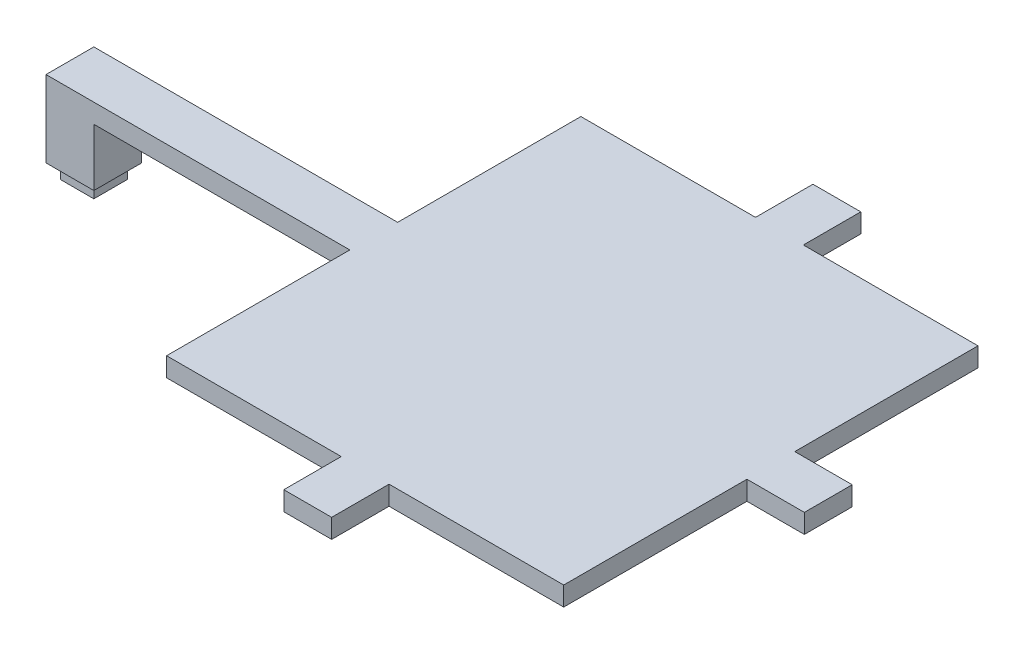
ISO-10303-21;
HEADER;
FILE_DESCRIPTION(('STEP AP214'),'2;1');
FILE_NAME('part.step','',(''),(''),'','','');
FILE_SCHEMA(('AUTOMOTIVE_DESIGN { 1 0 10303 214 1 1 1 1 }'));
ENDSEC;
DATA;
#1=APPLICATION_CONTEXT('core data for automotive mechanical design processes');
#2=APPLICATION_PROTOCOL_DEFINITION('international standard','automotive_design',2000,#1);
#3=PRODUCT_CONTEXT('',#1,'mechanical');
#4=PRODUCT('Part','Part','',(#3));
#5=PRODUCT_RELATED_PRODUCT_CATEGORY('part','',(#4));
#6=PRODUCT_DEFINITION_FORMATION('','',#4);
#7=PRODUCT_DEFINITION_CONTEXT('part definition',#1,'design');
#8=PRODUCT_DEFINITION('design','',#6,#7);
#9=PRODUCT_DEFINITION_SHAPE('','',#8);
#10=(LENGTH_UNIT() NAMED_UNIT(*) SI_UNIT(.MILLI.,.METRE.));
#11=(NAMED_UNIT(*) PLANE_ANGLE_UNIT() SI_UNIT($,.RADIAN.));
#12=(NAMED_UNIT(*) SI_UNIT($,.STERADIAN.) SOLID_ANGLE_UNIT());
#13=UNCERTAINTY_MEASURE_WITH_UNIT(LENGTH_MEASURE(1.E-05),#10,'distance_accuracy_value','');
#14=(GEOMETRIC_REPRESENTATION_CONTEXT(3) GLOBAL_UNCERTAINTY_ASSIGNED_CONTEXT((#13)) GLOBAL_UNIT_ASSIGNED_CONTEXT((#10,
#11,#12)) REPRESENTATION_CONTEXT('',''));
#15=CARTESIAN_POINT('',(0.,0.,0.));
#16=DIRECTION('',(0.,0.,1.));
#17=DIRECTION('',(1.,0.,0.));
#18=AXIS2_PLACEMENT_3D('',#15,#16,#17);
#19=CARTESIAN_POINT('',(58.5,19.,-43.2944735512046));
#20=DIRECTION('',(1.,0.,0.));
#21=DIRECTION('',(0.,0.,-1.));
#22=AXIS2_PLACEMENT_3D('',#19,#20,#21);
#23=PLANE('',#22);
#24=DIRECTION('',(0.,0.,1.));
#25=VECTOR('',#24,1.);
#26=CARTESIAN_POINT('',(58.5,15.,-43.2944735512046));
#27=LINE('',#26,#25);
#28=CARTESIAN_POINT('',(58.5,15.,-43.2944735512046));
#29=VERTEX_POINT('',#28);
#30=CARTESIAN_POINT('',(58.5,15.,-5.));
#31=VERTEX_POINT('',#30);
#32=EDGE_CURVE('E225',#29,#31,#27,.T.);
#33=ORIENTED_EDGE('',*,*,#32,.T.);
#34=DIRECTION('',(0.,1.,0.));
#35=VECTOR('',#34,1.);
#36=CARTESIAN_POINT('',(58.5,19.,-5.));
#37=LINE('',#36,#35);
#38=CARTESIAN_POINT('',(58.5,19.,-5.));
#39=VERTEX_POINT('',#38);
#40=EDGE_CURVE('E318',#31,#39,#37,.T.);
#41=ORIENTED_EDGE('',*,*,#40,.T.);
#42=DIRECTION('',(0.,0.,1.));
#43=VECTOR('',#42,1.);
#44=CARTESIAN_POINT('',(58.5,19.,-43.2944735512046));
#45=LINE('',#44,#43);
#46=CARTESIAN_POINT('',(58.5,19.,-43.2944735512046));
#47=VERTEX_POINT('',#46);
#48=EDGE_CURVE('E189',#47,#39,#45,.T.);
#49=ORIENTED_EDGE('',*,*,#48,.F.);
#50=DIRECTION('',(0.,-1.,0.));
#51=VECTOR('',#50,1.);
#52=CARTESIAN_POINT('',(58.5,19.,-43.2944735512046));
#53=LINE('',#52,#51);
#54=EDGE_CURVE('E183',#47,#29,#53,.T.);
#55=ORIENTED_EDGE('',*,*,#54,.T.);
#56=EDGE_LOOP('',(#33,#41,#49,#55));
#57=FACE_BOUND('',#56,.T.);
#58=ADVANCED_FACE('F33',(#57),#23,.F.);
#59=CARTESIAN_POINT('',(95.,19.,43.2944735512046));
#60=DIRECTION('',(0.,0.,-1.));
#61=DIRECTION('',(-1.,0.,0.));
#62=AXIS2_PLACEMENT_3D('',#59,#60,#61);
#63=PLANE('',#62);
#64=DIRECTION('',(1.,0.,0.));
#65=VECTOR('',#64,1.);
#66=CARTESIAN_POINT('',(95.,15.,43.2944735512046));
#67=LINE('',#66,#65);
#68=CARTESIAN_POINT('',(58.5,15.,43.2944735512046));
#69=VERTEX_POINT('',#68);
#70=CARTESIAN_POINT('',(95.,15.,43.2944735512046));
#71=VERTEX_POINT('',#70);
#72=EDGE_CURVE('E194',#69,#71,#67,.T.);
#73=ORIENTED_EDGE('',*,*,#72,.T.);
#74=DIRECTION('',(0.,-1.,0.));
#75=VECTOR('',#74,1.);
#76=CARTESIAN_POINT('',(95.,19.,43.2944735512046));
#77=LINE('',#76,#75);
#78=CARTESIAN_POINT('',(95.,19.,43.2944735512046));
#79=VERTEX_POINT('',#78);
#80=EDGE_CURVE('E11',#79,#71,#77,.T.);
#81=ORIENTED_EDGE('',*,*,#80,.F.);
#82=DIRECTION('',(1.,0.,0.));
#83=VECTOR('',#82,1.);
#84=CARTESIAN_POINT('',(95.,19.,43.2944735512046));
#85=LINE('',#84,#83);
#86=CARTESIAN_POINT('',(58.5,19.,43.2944735512046));
#87=VERTEX_POINT('',#86);
#88=EDGE_CURVE('E228',#87,#79,#85,.T.);
#89=ORIENTED_EDGE('',*,*,#88,.F.);
#90=DIRECTION('',(0.,-1.,0.));
#91=VECTOR('',#90,1.);
#92=CARTESIAN_POINT('',(58.5,19.,43.2944735512046));
#93=LINE('',#92,#91);
#94=EDGE_CURVE('E193',#87,#69,#93,.T.);
#95=ORIENTED_EDGE('',*,*,#94,.T.);
#96=EDGE_LOOP('',(#73,#81,#89,#95));
#97=FACE_BOUND('',#96,.T.);
#98=ADVANCED_FACE('F35',(#97),#63,.F.);
#99=CARTESIAN_POINT('',(95.,19.,43.2944735512046));
#100=DIRECTION('',(1.,0.,0.));
#101=DIRECTION('',(0.,0.,-1.));
#102=AXIS2_PLACEMENT_3D('',#99,#100,#101);
#103=PLANE('',#102);
#104=DIRECTION('',(0.,0.,1.));
#105=VECTOR('',#104,1.);
#106=CARTESIAN_POINT('',(95.,15.,43.2944735512046));
#107=LINE('',#106,#105);
#108=CARTESIAN_POINT('',(95.,15.,55.2944735512046));
#109=VERTEX_POINT('',#108);
#110=EDGE_CURVE('E197',#71,#109,#107,.T.);
#111=ORIENTED_EDGE('',*,*,#110,.T.);
#112=DIRECTION('',(0.,-1.,0.));
#113=VECTOR('',#112,1.);
#114=CARTESIAN_POINT('',(95.,19.,55.2944735512046));
#115=LINE('',#114,#113);
#116=CARTESIAN_POINT('',(95.,19.,55.2944735512046));
#117=VERTEX_POINT('',#116);
#118=EDGE_CURVE('E41',#117,#109,#115,.T.);
#119=ORIENTED_EDGE('',*,*,#118,.F.);
#120=DIRECTION('',(0.,0.,1.));
#121=VECTOR('',#120,1.);
#122=CARTESIAN_POINT('',(95.,19.,43.2944735512046));
#123=LINE('',#122,#121);
#124=EDGE_CURVE('E122',#79,#117,#123,.T.);
#125=ORIENTED_EDGE('',*,*,#124,.F.);
#126=ORIENTED_EDGE('',*,*,#80,.T.);
#127=EDGE_LOOP('',(#111,#119,#125,#126));
#128=FACE_BOUND('',#127,.T.);
#129=ADVANCED_FACE('F357',(#128),#103,.F.);
#130=CARTESIAN_POINT('',(95.,19.,55.2944735512046));
#131=DIRECTION('',(0.,0.,-1.));
#132=DIRECTION('',(-1.,0.,0.));
#133=AXIS2_PLACEMENT_3D('',#130,#131,#132);
#134=PLANE('',#133);
#135=DIRECTION('',(1.,0.,0.));
#136=VECTOR('',#135,1.);
#137=CARTESIAN_POINT('',(95.,15.,55.2944735512046));
#138=LINE('',#137,#136);
#139=CARTESIAN_POINT('',(105.,15.,55.2944735512046));
#140=VERTEX_POINT('',#139);
#141=EDGE_CURVE('E200',#109,#140,#138,.T.);
#142=ORIENTED_EDGE('',*,*,#141,.T.);
#143=DIRECTION('',(0.,-1.,0.));
#144=VECTOR('',#143,1.);
#145=CARTESIAN_POINT('',(105.,19.,55.2944735512046));
#146=LINE('',#145,#144);
#147=CARTESIAN_POINT('',(105.,19.,55.2944735512046));
#148=VERTEX_POINT('',#147);
#149=EDGE_CURVE('E259',#148,#140,#146,.T.);
#150=ORIENTED_EDGE('',*,*,#149,.F.);
#151=DIRECTION('',(1.,0.,0.));
#152=VECTOR('',#151,1.);
#153=CARTESIAN_POINT('',(95.,19.,55.2944735512046));
#154=LINE('',#153,#152);
#155=EDGE_CURVE('E267',#117,#148,#154,.T.);
#156=ORIENTED_EDGE('',*,*,#155,.F.);
#157=ORIENTED_EDGE('',*,*,#118,.T.);
#158=EDGE_LOOP('',(#142,#150,#156,#157));
#159=FACE_BOUND('',#158,.T.);
#160=ADVANCED_FACE('F265',(#159),#134,.F.);
#161=CARTESIAN_POINT('',(105.,19.,43.2944735512046));
#162=DIRECTION('',(-1.,0.,0.));
#163=DIRECTION('',(0.,0.,1.));
#164=AXIS2_PLACEMENT_3D('',#161,#162,#163);
#165=PLANE('',#164);
#166=DIRECTION('',(0.,0.,-1.));
#167=VECTOR('',#166,1.);
#168=CARTESIAN_POINT('',(105.,15.,43.2944735512046));
#169=LINE('',#168,#167);
#170=CARTESIAN_POINT('',(105.,15.,43.2944735512046));
#171=VERTEX_POINT('',#170);
#172=EDGE_CURVE('E202',#140,#171,#169,.T.);
#173=ORIENTED_EDGE('',*,*,#172,.T.);
#174=DIRECTION('',(0.,-1.,0.));
#175=VECTOR('',#174,1.);
#176=CARTESIAN_POINT('',(105.,19.,43.2944735512046));
#177=LINE('',#176,#175);
#178=CARTESIAN_POINT('',(105.,19.,43.2944735512046));
#179=VERTEX_POINT('',#178);
#180=EDGE_CURVE('E256',#179,#171,#177,.T.);
#181=ORIENTED_EDGE('',*,*,#180,.F.);
#182=DIRECTION('',(0.,0.,-1.));
#183=VECTOR('',#182,1.);
#184=CARTESIAN_POINT('',(105.,19.,43.2944735512046));
#185=LINE('',#184,#183);
#186=EDGE_CURVE('E285',#148,#179,#185,.T.);
#187=ORIENTED_EDGE('',*,*,#186,.F.);
#188=ORIENTED_EDGE('',*,*,#149,.T.);
#189=EDGE_LOOP('',(#173,#181,#187,#188));
#190=FACE_BOUND('',#189,.T.);
#191=ADVANCED_FACE('F276',(#190),#165,.F.);
#192=CARTESIAN_POINT('',(141.5,19.,43.2944735512046));
#193=DIRECTION('',(0.,0.,-1.));
#194=DIRECTION('',(-1.,0.,0.));
#195=AXIS2_PLACEMENT_3D('',#192,#193,#194);
#196=PLANE('',#195);
#197=DIRECTION('',(1.,0.,0.));
#198=VECTOR('',#197,1.);
#199=CARTESIAN_POINT('',(141.5,15.,43.2944735512046));
#200=LINE('',#199,#198);
#201=CARTESIAN_POINT('',(141.5,15.,43.2944735512046));
#202=VERTEX_POINT('',#201);
#203=EDGE_CURVE('E204',#171,#202,#200,.T.);
#204=ORIENTED_EDGE('',*,*,#203,.T.);
#205=DIRECTION('',(0.,-1.,0.));
#206=VECTOR('',#205,1.);
#207=CARTESIAN_POINT('',(141.5,19.,43.2944735512046));
#208=LINE('',#207,#206);
#209=CARTESIAN_POINT('',(141.5,19.,43.2944735512046));
#210=VERTEX_POINT('',#209);
#211=EDGE_CURVE('E253',#210,#202,#208,.T.);
#212=ORIENTED_EDGE('',*,*,#211,.F.);
#213=DIRECTION('',(1.,0.,0.));
#214=VECTOR('',#213,1.);
#215=CARTESIAN_POINT('',(141.5,19.,43.2944735512046));
#216=LINE('',#215,#214);
#217=EDGE_CURVE('E282',#179,#210,#216,.T.);
#218=ORIENTED_EDGE('',*,*,#217,.F.);
#219=ORIENTED_EDGE('',*,*,#180,.T.);
#220=EDGE_LOOP('',(#204,#212,#218,#219));
#221=FACE_BOUND('',#220,.T.);
#222=ADVANCED_FACE('F280',(#221),#196,.F.);
#223=CARTESIAN_POINT('',(141.5,19.,4.99999999999998));
#224=DIRECTION('',(-1.,0.,0.));
#225=DIRECTION('',(0.,0.,1.));
#226=AXIS2_PLACEMENT_3D('',#223,#224,#225);
#227=PLANE('',#226);
#228=DIRECTION('',(0.,0.,-1.));
#229=VECTOR('',#228,1.);
#230=CARTESIAN_POINT('',(141.5,15.,4.99999999999998));
#231=LINE('',#230,#229);
#232=CARTESIAN_POINT('',(141.5,15.,4.99999999999998));
#233=VERTEX_POINT('',#232);
#234=EDGE_CURVE('E206',#202,#233,#231,.T.);
#235=ORIENTED_EDGE('',*,*,#234,.T.);
#236=DIRECTION('',(0.,-1.,0.));
#237=VECTOR('',#236,1.);
#238=CARTESIAN_POINT('',(141.5,19.,4.99999999999998));
#239=LINE('',#238,#237);
#240=CARTESIAN_POINT('',(141.5,19.,4.99999999999998));
#241=VERTEX_POINT('',#240);
#242=EDGE_CURVE('E250',#241,#233,#239,.T.);
#243=ORIENTED_EDGE('',*,*,#242,.F.);
#244=DIRECTION('',(0.,0.,-1.));
#245=VECTOR('',#244,1.);
#246=CARTESIAN_POINT('',(141.5,19.,4.99999999999998));
#247=LINE('',#246,#245);
#248=EDGE_CURVE('E284',#210,#241,#247,.T.);
#249=ORIENTED_EDGE('',*,*,#248,.F.);
#250=ORIENTED_EDGE('',*,*,#211,.T.);
#251=EDGE_LOOP('',(#235,#243,#249,#250));
#252=FACE_BOUND('',#251,.T.);
#253=ADVANCED_FACE('F692',(#252),#227,.F.);
#254=CARTESIAN_POINT('',(141.5,19.,4.99999999999998));
#255=DIRECTION('',(0.,0.,-1.));
#256=DIRECTION('',(-1.,0.,0.));
#257=AXIS2_PLACEMENT_3D('',#254,#255,#256);
#258=PLANE('',#257);
#259=DIRECTION('',(1.,0.,0.));
#260=VECTOR('',#259,1.);
#261=CARTESIAN_POINT('',(141.5,15.,4.99999999999998));
#262=LINE('',#261,#260);
#263=CARTESIAN_POINT('',(153.5,15.,4.99999999999998));
#264=VERTEX_POINT('',#263);
#265=EDGE_CURVE('E208',#233,#264,#262,.T.);
#266=ORIENTED_EDGE('',*,*,#265,.T.);
#267=DIRECTION('',(0.,-1.,0.));
#268=VECTOR('',#267,1.);
#269=CARTESIAN_POINT('',(153.5,19.,4.99999999999998));
#270=LINE('',#269,#268);
#271=CARTESIAN_POINT('',(153.5,19.,4.99999999999998));
#272=VERTEX_POINT('',#271);
#273=EDGE_CURVE('E247',#272,#264,#270,.T.);
#274=ORIENTED_EDGE('',*,*,#273,.F.);
#275=DIRECTION('',(1.,0.,0.));
#276=VECTOR('',#275,1.);
#277=CARTESIAN_POINT('',(141.5,19.,4.99999999999998));
#278=LINE('',#277,#276);
#279=EDGE_CURVE('E287',#241,#272,#278,.T.);
#280=ORIENTED_EDGE('',*,*,#279,.F.);
#281=ORIENTED_EDGE('',*,*,#242,.T.);
#282=EDGE_LOOP('',(#266,#274,#280,#281));
#283=FACE_BOUND('',#282,.T.);
#284=ADVANCED_FACE('F683',(#283),#258,.F.);
#285=CARTESIAN_POINT('',(153.5,19.,-5.00000000000001));
#286=DIRECTION('',(-1.,0.,0.));
#287=DIRECTION('',(0.,0.,1.));
#288=AXIS2_PLACEMENT_3D('',#285,#286,#287);
#289=PLANE('',#288);
#290=DIRECTION('',(0.,0.,-1.));
#291=VECTOR('',#290,1.);
#292=CARTESIAN_POINT('',(153.5,15.,-5.00000000000001));
#293=LINE('',#292,#291);
#294=CARTESIAN_POINT('',(153.5,15.,-5.00000000000001));
#295=VERTEX_POINT('',#294);
#296=EDGE_CURVE('E210',#264,#295,#293,.T.);
#297=ORIENTED_EDGE('',*,*,#296,.T.);
#298=DIRECTION('',(0.,-1.,0.));
#299=VECTOR('',#298,1.);
#300=CARTESIAN_POINT('',(153.5,19.,-5.00000000000001));
#301=LINE('',#300,#299);
#302=CARTESIAN_POINT('',(153.5,19.,-5.00000000000001));
#303=VERTEX_POINT('',#302);
#304=EDGE_CURVE('E244',#303,#295,#301,.T.);
#305=ORIENTED_EDGE('',*,*,#304,.F.);
#306=DIRECTION('',(0.,0.,-1.));
#307=VECTOR('',#306,1.);
#308=CARTESIAN_POINT('',(153.5,19.,-5.00000000000001));
#309=LINE('',#308,#307);
#310=EDGE_CURVE('E293',#272,#303,#309,.T.);
#311=ORIENTED_EDGE('',*,*,#310,.F.);
#312=ORIENTED_EDGE('',*,*,#273,.T.);
#313=EDGE_LOOP('',(#297,#305,#311,#312));
#314=FACE_BOUND('',#313,.T.);
#315=ADVANCED_FACE('F674',(#314),#289,.F.);
#316=CARTESIAN_POINT('',(141.5,19.,-5.00000000000001));
#317=DIRECTION('',(0.,0.,1.));
#318=DIRECTION('',(1.,0.,0.));
#319=AXIS2_PLACEMENT_3D('',#316,#317,#318);
#320=PLANE('',#319);
#321=DIRECTION('',(-1.,0.,0.));
#322=VECTOR('',#321,1.);
#323=CARTESIAN_POINT('',(141.5,15.,-5.00000000000001));
#324=LINE('',#323,#322);
#325=CARTESIAN_POINT('',(141.5,15.,-5.00000000000001));
#326=VERTEX_POINT('',#325);
#327=EDGE_CURVE('E212',#295,#326,#324,.T.);
#328=ORIENTED_EDGE('',*,*,#327,.T.);
#329=DIRECTION('',(0.,-1.,0.));
#330=VECTOR('',#329,1.);
#331=CARTESIAN_POINT('',(141.5,19.,-5.00000000000001));
#332=LINE('',#331,#330);
#333=CARTESIAN_POINT('',(141.5,19.,-5.00000000000001));
#334=VERTEX_POINT('',#333);
#335=EDGE_CURVE('E241',#334,#326,#332,.T.);
#336=ORIENTED_EDGE('',*,*,#335,.F.);
#337=DIRECTION('',(-1.,0.,0.));
#338=VECTOR('',#337,1.);
#339=CARTESIAN_POINT('',(141.5,19.,-5.00000000000001));
#340=LINE('',#339,#338);
#341=EDGE_CURVE('E295',#303,#334,#340,.T.);
#342=ORIENTED_EDGE('',*,*,#341,.F.);
#343=ORIENTED_EDGE('',*,*,#304,.T.);
#344=EDGE_LOOP('',(#328,#336,#342,#343));
#345=FACE_BOUND('',#344,.T.);
#346=ADVANCED_FACE('F665',(#345),#320,.F.);
#347=CARTESIAN_POINT('',(141.5,19.,-5.00000000000001));
#348=DIRECTION('',(-1.,0.,0.));
#349=DIRECTION('',(0.,0.,1.));
#350=AXIS2_PLACEMENT_3D('',#347,#348,#349);
#351=PLANE('',#350);
#352=DIRECTION('',(0.,0.,-1.));
#353=VECTOR('',#352,1.);
#354=CARTESIAN_POINT('',(141.5,15.,-5.00000000000001));
#355=LINE('',#354,#353);
#356=CARTESIAN_POINT('',(141.5,15.,-43.2944735512046));
#357=VERTEX_POINT('',#356);
#358=EDGE_CURVE('E214',#326,#357,#355,.T.);
#359=ORIENTED_EDGE('',*,*,#358,.T.);
#360=DIRECTION('',(0.,-1.,0.));
#361=VECTOR('',#360,1.);
#362=CARTESIAN_POINT('',(141.5,19.,-43.2944735512046));
#363=LINE('',#362,#361);
#364=CARTESIAN_POINT('',(141.5,19.,-43.2944735512046));
#365=VERTEX_POINT('',#364);
#366=EDGE_CURVE('E238',#365,#357,#363,.T.);
#367=ORIENTED_EDGE('',*,*,#366,.F.);
#368=DIRECTION('',(0.,0.,-1.));
#369=VECTOR('',#368,1.);
#370=CARTESIAN_POINT('',(141.5,19.,-5.00000000000001));
#371=LINE('',#370,#369);
#372=EDGE_CURVE('E297',#334,#365,#371,.T.);
#373=ORIENTED_EDGE('',*,*,#372,.F.);
#374=ORIENTED_EDGE('',*,*,#335,.T.);
#375=EDGE_LOOP('',(#359,#367,#373,#374));
#376=FACE_BOUND('',#375,.T.);
#377=ADVANCED_FACE('F656',(#376),#351,.F.);
#378=CARTESIAN_POINT('',(141.5,19.,-43.2944735512046));
#379=DIRECTION('',(0.,0.,1.));
#380=DIRECTION('',(1.,0.,0.));
#381=AXIS2_PLACEMENT_3D('',#378,#379,#380);
#382=PLANE('',#381);
#383=DIRECTION('',(-1.,0.,0.));
#384=VECTOR('',#383,1.);
#385=CARTESIAN_POINT('',(141.5,15.,-43.2944735512046));
#386=LINE('',#385,#384);
#387=CARTESIAN_POINT('',(105.,15.,-43.2944735512046));
#388=VERTEX_POINT('',#387);
#389=EDGE_CURVE('E216',#357,#388,#386,.T.);
#390=ORIENTED_EDGE('',*,*,#389,.T.);
#391=DIRECTION('',(0.,-1.,0.));
#392=VECTOR('',#391,1.);
#393=CARTESIAN_POINT('',(105.,19.,-43.2944735512046));
#394=LINE('',#393,#392);
#395=CARTESIAN_POINT('',(105.,19.,-43.2944735512046));
#396=VERTEX_POINT('',#395);
#397=EDGE_CURVE('E235',#396,#388,#394,.T.);
#398=ORIENTED_EDGE('',*,*,#397,.F.);
#399=DIRECTION('',(-1.,0.,0.));
#400=VECTOR('',#399,1.);
#401=CARTESIAN_POINT('',(141.5,19.,-43.2944735512046));
#402=LINE('',#401,#400);
#403=EDGE_CURVE('E299',#365,#396,#402,.T.);
#404=ORIENTED_EDGE('',*,*,#403,.F.);
#405=ORIENTED_EDGE('',*,*,#366,.T.);
#406=EDGE_LOOP('',(#390,#398,#404,#405));
#407=FACE_BOUND('',#406,.T.);
#408=ADVANCED_FACE('F648',(#407),#382,.F.);
#409=CARTESIAN_POINT('',(105.,19.,-43.2944735512046));
#410=DIRECTION('',(-1.,0.,0.));
#411=DIRECTION('',(0.,0.,1.));
#412=AXIS2_PLACEMENT_3D('',#409,#410,#411);
#413=PLANE('',#412);
#414=DIRECTION('',(0.,0.,-1.));
#415=VECTOR('',#414,1.);
#416=CARTESIAN_POINT('',(105.,15.,-43.2944735512046));
#417=LINE('',#416,#415);
#418=CARTESIAN_POINT('',(105.,15.,-55.2944735512046));
#419=VERTEX_POINT('',#418);
#420=EDGE_CURVE('E218',#388,#419,#417,.T.);
#421=ORIENTED_EDGE('',*,*,#420,.T.);
#422=DIRECTION('',(0.,-1.,0.));
#423=VECTOR('',#422,1.);
#424=CARTESIAN_POINT('',(105.,19.,-55.2944735512046));
#425=LINE('',#424,#423);
#426=CARTESIAN_POINT('',(105.,19.,-55.2944735512046));
#427=VERTEX_POINT('',#426);
#428=EDGE_CURVE('E232',#427,#419,#425,.T.);
#429=ORIENTED_EDGE('',*,*,#428,.F.);
#430=DIRECTION('',(0.,0.,-1.));
#431=VECTOR('',#430,1.);
#432=CARTESIAN_POINT('',(105.,19.,-43.2944735512046));
#433=LINE('',#432,#431);
#434=EDGE_CURVE('E301',#396,#427,#433,.T.);
#435=ORIENTED_EDGE('',*,*,#434,.F.);
#436=ORIENTED_EDGE('',*,*,#397,.T.);
#437=EDGE_LOOP('',(#421,#429,#435,#436));
#438=FACE_BOUND('',#437,.T.);
#439=ADVANCED_FACE('F307',(#438),#413,.F.);
#440=CARTESIAN_POINT('',(105.,19.,-55.2944735512046));
#441=DIRECTION('',(0.,0.,1.));
#442=DIRECTION('',(1.,0.,0.));
#443=AXIS2_PLACEMENT_3D('',#440,#441,#442);
#444=PLANE('',#443);
#445=DIRECTION('',(-1.,0.,0.));
#446=VECTOR('',#445,1.);
#447=CARTESIAN_POINT('',(105.,15.,-55.2944735512046));
#448=LINE('',#447,#446);
#449=CARTESIAN_POINT('',(95.,15.,-55.2944735512046));
#450=VERTEX_POINT('',#449);
#451=EDGE_CURVE('E220',#419,#450,#448,.T.);
#452=ORIENTED_EDGE('',*,*,#451,.T.);
#453=DIRECTION('',(0.,-1.,0.));
#454=VECTOR('',#453,1.);
#455=CARTESIAN_POINT('',(95.,19.,-55.2944735512046));
#456=LINE('',#455,#454);
#457=CARTESIAN_POINT('',(95.,19.,-55.2944735512046));
#458=VERTEX_POINT('',#457);
#459=EDGE_CURVE('E182',#458,#450,#456,.T.);
#460=ORIENTED_EDGE('',*,*,#459,.F.);
#461=DIRECTION('',(-1.,0.,0.));
#462=VECTOR('',#461,1.);
#463=CARTESIAN_POINT('',(105.,19.,-55.2944735512046));
#464=LINE('',#463,#462);
#465=EDGE_CURVE('E170',#427,#458,#464,.T.);
#466=ORIENTED_EDGE('',*,*,#465,.F.);
#467=ORIENTED_EDGE('',*,*,#428,.T.);
#468=EDGE_LOOP('',(#452,#460,#466,#467));
#469=FACE_BOUND('',#468,.T.);
#470=ADVANCED_FACE('F311',(#469),#444,.F.);
#471=CARTESIAN_POINT('',(95.,19.,-55.2944735512046));
#472=DIRECTION('',(1.,0.,0.));
#473=DIRECTION('',(0.,0.,-1.));
#474=AXIS2_PLACEMENT_3D('',#471,#472,#473);
#475=PLANE('',#474);
#476=DIRECTION('',(0.,0.,1.));
#477=VECTOR('',#476,1.);
#478=CARTESIAN_POINT('',(95.,15.,-55.2944735512046));
#479=LINE('',#478,#477);
#480=CARTESIAN_POINT('',(95.,15.,-43.2944735512046));
#481=VERTEX_POINT('',#480);
#482=EDGE_CURVE('E179',#450,#481,#479,.T.);
#483=ORIENTED_EDGE('',*,*,#482,.T.);
#484=DIRECTION('',(0.,-1.,0.));
#485=VECTOR('',#484,1.);
#486=CARTESIAN_POINT('',(95.,19.,-43.2944735512046));
#487=LINE('',#486,#485);
#488=CARTESIAN_POINT('',(95.,19.,-43.2944735512046));
#489=VERTEX_POINT('',#488);
#490=EDGE_CURVE('E176',#489,#481,#487,.T.);
#491=ORIENTED_EDGE('',*,*,#490,.F.);
#492=DIRECTION('',(0.,0.,1.));
#493=VECTOR('',#492,1.);
#494=CARTESIAN_POINT('',(95.,19.,-55.2944735512046));
#495=LINE('',#494,#493);
#496=EDGE_CURVE('E162',#458,#489,#495,.T.);
#497=ORIENTED_EDGE('',*,*,#496,.F.);
#498=ORIENTED_EDGE('',*,*,#459,.T.);
#499=EDGE_LOOP('',(#483,#491,#497,#498));
#500=FACE_BOUND('',#499,.T.);
#501=ADVANCED_FACE('F177',(#500),#475,.F.);
#502=CARTESIAN_POINT('',(95.,19.,-43.2944735512046));
#503=DIRECTION('',(0.,0.,1.));
#504=DIRECTION('',(1.,0.,0.));
#505=AXIS2_PLACEMENT_3D('',#502,#503,#504);
#506=PLANE('',#505);
#507=DIRECTION('',(-1.,0.,0.));
#508=VECTOR('',#507,1.);
#509=CARTESIAN_POINT('',(95.,15.,-43.2944735512046));
#510=LINE('',#509,#508);
#511=EDGE_CURVE('E223',#481,#29,#510,.T.);
#512=ORIENTED_EDGE('',*,*,#511,.T.);
#513=ORIENTED_EDGE('',*,*,#54,.F.);
#514=DIRECTION('',(-1.,0.,0.));
#515=VECTOR('',#514,1.);
#516=CARTESIAN_POINT('',(95.,19.,-43.2944735512046));
#517=LINE('',#516,#515);
#518=EDGE_CURVE('E167',#489,#47,#517,.T.);
#519=ORIENTED_EDGE('',*,*,#518,.F.);
#520=ORIENTED_EDGE('',*,*,#490,.T.);
#521=EDGE_LOOP('',(#512,#513,#519,#520));
#522=FACE_BOUND('',#521,.T.);
#523=ADVANCED_FACE('F185',(#522),#506,.F.);
#524=CARTESIAN_POINT('',(58.5,19.,5.));
#525=VERTEX_POINT('',#524);
#526=EDGE_CURVE('E57',#525,#87,#45,.T.);
#527=ORIENTED_EDGE('',*,*,#526,.F.);
#528=DIRECTION('',(0.,-1.,0.));
#529=VECTOR('',#528,1.);
#530=CARTESIAN_POINT('',(58.5,19.,5.));
#531=LINE('',#530,#529);
#532=CARTESIAN_POINT('',(58.5,15.,5.));
#533=VERTEX_POINT('',#532);
#534=EDGE_CURVE('E338',#525,#533,#531,.T.);
#535=ORIENTED_EDGE('',*,*,#534,.T.);
#536=EDGE_CURVE('E114',#533,#69,#27,.T.);
#537=ORIENTED_EDGE('',*,*,#536,.T.);
#538=ORIENTED_EDGE('',*,*,#94,.F.);
#539=EDGE_LOOP('',(#527,#535,#537,#538));
#540=FACE_BOUND('',#539,.T.);
#541=ADVANCED_FACE('F366',(#540),#23,.F.);
#542=CARTESIAN_POINT('',(0.,19.,0.));
#543=DIRECTION('',(0.,1.,0.));
#544=DIRECTION('',(0.,0.,1.));
#545=AXIS2_PLACEMENT_3D('',#542,#543,#544);
#546=PLANE('',#545);
#547=ORIENTED_EDGE('',*,*,#88,.T.);
#548=ORIENTED_EDGE('',*,*,#124,.T.);
#549=ORIENTED_EDGE('',*,*,#155,.T.);
#550=ORIENTED_EDGE('',*,*,#186,.T.);
#551=ORIENTED_EDGE('',*,*,#217,.T.);
#552=ORIENTED_EDGE('',*,*,#248,.T.);
#553=ORIENTED_EDGE('',*,*,#279,.T.);
#554=ORIENTED_EDGE('',*,*,#310,.T.);
#555=ORIENTED_EDGE('',*,*,#341,.T.);
#556=ORIENTED_EDGE('',*,*,#372,.T.);
#557=ORIENTED_EDGE('',*,*,#403,.T.);
#558=ORIENTED_EDGE('',*,*,#434,.T.);
#559=ORIENTED_EDGE('',*,*,#465,.T.);
#560=ORIENTED_EDGE('',*,*,#496,.T.);
#561=ORIENTED_EDGE('',*,*,#518,.T.);
#562=ORIENTED_EDGE('',*,*,#48,.T.);
#563=DIRECTION('',(-1.,0.,0.));
#564=VECTOR('',#563,1.);
#565=CARTESIAN_POINT('',(58.5,19.,-5.));
#566=LINE('',#565,#564);
#567=CARTESIAN_POINT('',(-5.,19.,-5.));
#568=VERTEX_POINT('',#567);
#569=EDGE_CURVE('E198',#39,#568,#566,.T.);
#570=ORIENTED_EDGE('',*,*,#569,.T.);
#571=DIRECTION('',(0.,0.,1.));
#572=VECTOR('',#571,1.);
#573=CARTESIAN_POINT('',(-5.,19.,-5.));
#574=LINE('',#573,#572);
#575=CARTESIAN_POINT('',(-5.,19.,5.));
#576=VERTEX_POINT('',#575);
#577=EDGE_CURVE('E440',#568,#576,#574,.T.);
#578=ORIENTED_EDGE('',*,*,#577,.T.);
#579=DIRECTION('',(-1.,0.,0.));
#580=VECTOR('',#579,1.);
#581=CARTESIAN_POINT('',(58.5,19.,5.));
#582=LINE('',#581,#580);
#583=EDGE_CURVE('E349',#525,#576,#582,.T.);
#584=ORIENTED_EDGE('',*,*,#583,.F.);
#585=ORIENTED_EDGE('',*,*,#526,.T.);
#586=EDGE_LOOP('',(#547,#548,#549,#550,#551,#552,#553,#554,#555,#556,#557,#558,#559,#560,#561,
#562,#570,#578,#584,#585));
#587=FACE_BOUND('',#586,.T.);
#588=ADVANCED_FACE('F164',(#587),#546,.T.);
#589=CARTESIAN_POINT('',(0.,15.,0.));
#590=DIRECTION('',(0.,1.,0.));
#591=DIRECTION('',(0.,0.,1.));
#592=AXIS2_PLACEMENT_3D('',#589,#590,#591);
#593=PLANE('',#592);
#594=ORIENTED_EDGE('',*,*,#72,.F.);
#595=ORIENTED_EDGE('',*,*,#536,.F.);
#596=DIRECTION('',(-1.,0.,0.));
#597=VECTOR('',#596,1.);
#598=CARTESIAN_POINT('',(58.5,15.,5.));
#599=LINE('',#598,#597);
#600=CARTESIAN_POINT('',(5.,15.,5.));
#601=VERTEX_POINT('',#600);
#602=EDGE_CURVE('E48',#533,#601,#599,.T.);
#603=ORIENTED_EDGE('',*,*,#602,.T.);
#604=DIRECTION('',(0.,0.,-1.));
#605=VECTOR('',#604,1.);
#606=CARTESIAN_POINT('',(5.,15.,-5.));
#607=LINE('',#606,#605);
#608=CARTESIAN_POINT('',(5.,15.,-5.));
#609=VERTEX_POINT('',#608);
#610=EDGE_CURVE('E336',#601,#609,#607,.T.);
#611=ORIENTED_EDGE('',*,*,#610,.T.);
#612=DIRECTION('',(-1.,0.,0.));
#613=VECTOR('',#612,1.);
#614=CARTESIAN_POINT('',(58.5,15.,-5.));
#615=LINE('',#614,#613);
#616=EDGE_CURVE('E334',#31,#609,#615,.T.);
#617=ORIENTED_EDGE('',*,*,#616,.F.);
#618=ORIENTED_EDGE('',*,*,#32,.F.);
#619=ORIENTED_EDGE('',*,*,#511,.F.);
#620=ORIENTED_EDGE('',*,*,#482,.F.);
#621=ORIENTED_EDGE('',*,*,#451,.F.);
#622=ORIENTED_EDGE('',*,*,#420,.F.);
#623=ORIENTED_EDGE('',*,*,#389,.F.);
#624=ORIENTED_EDGE('',*,*,#358,.F.);
#625=ORIENTED_EDGE('',*,*,#327,.F.);
#626=ORIENTED_EDGE('',*,*,#296,.F.);
#627=ORIENTED_EDGE('',*,*,#265,.F.);
#628=ORIENTED_EDGE('',*,*,#234,.F.);
#629=ORIENTED_EDGE('',*,*,#203,.F.);
#630=ORIENTED_EDGE('',*,*,#172,.F.);
#631=ORIENTED_EDGE('',*,*,#141,.F.);
#632=ORIENTED_EDGE('',*,*,#110,.F.);
#633=EDGE_LOOP('',(#594,#595,#603,#611,#617,#618,#619,#620,#621,#622,#623,#624,#625,#626,#627,
#628,#629,#630,#631,#632));
#634=FACE_BOUND('',#633,.T.);
#635=ADVANCED_FACE('F271',(#634),#593,.F.);
#636=CARTESIAN_POINT('',(58.5,19.,-5.));
#637=DIRECTION('',(0.,0.,1.));
#638=DIRECTION('',(1.,0.,0.));
#639=AXIS2_PLACEMENT_3D('',#636,#637,#638);
#640=PLANE('',#639);
#641=ORIENTED_EDGE('',*,*,#616,.T.);
#642=DIRECTION('',(0.,-1.,0.));
#643=VECTOR('',#642,1.);
#644=CARTESIAN_POINT('',(5.,15.,-5.));
#645=LINE('',#644,#643);
#646=CARTESIAN_POINT('',(5.,3.,-5.));
#647=VERTEX_POINT('',#646);
#648=EDGE_CURVE('E458',#609,#647,#645,.T.);
#649=ORIENTED_EDGE('',*,*,#648,.T.);
#650=DIRECTION('',(-1.,0.,0.));
#651=VECTOR('',#650,1.);
#652=CARTESIAN_POINT('',(-5.,3.,-5.));
#653=LINE('',#652,#651);
#654=CARTESIAN_POINT('',(-5.,3.,-5.));
#655=VERTEX_POINT('',#654);
#656=EDGE_CURVE('E449',#647,#655,#653,.T.);
#657=ORIENTED_EDGE('',*,*,#656,.T.);
#658=DIRECTION('',(0.,-1.,0.));
#659=VECTOR('',#658,1.);
#660=CARTESIAN_POINT('',(-5.,15.,-5.));
#661=LINE('',#660,#659);
#662=EDGE_CURVE('E443',#568,#655,#661,.T.);
#663=ORIENTED_EDGE('',*,*,#662,.F.);
#664=ORIENTED_EDGE('',*,*,#569,.F.);
#665=ORIENTED_EDGE('',*,*,#40,.F.);
#666=EDGE_LOOP('',(#641,#649,#657,#663,#664,#665));
#667=FACE_BOUND('',#666,.T.);
#668=ADVANCED_FACE('F340',(#667),#640,.F.);
#669=CARTESIAN_POINT('',(58.5,19.,5.));
#670=DIRECTION('',(0.,0.,-1.));
#671=DIRECTION('',(-1.,0.,0.));
#672=AXIS2_PLACEMENT_3D('',#669,#670,#671);
#673=PLANE('',#672);
#674=ORIENTED_EDGE('',*,*,#583,.T.);
#675=DIRECTION('',(0.,-1.,0.));
#676=VECTOR('',#675,1.);
#677=CARTESIAN_POINT('',(-5.,15.,5.));
#678=LINE('',#677,#676);
#679=CARTESIAN_POINT('',(-5.,3.,5.));
#680=VERTEX_POINT('',#679);
#681=EDGE_CURVE('E434',#576,#680,#678,.T.);
#682=ORIENTED_EDGE('',*,*,#681,.T.);
#683=DIRECTION('',(1.,0.,0.));
#684=VECTOR('',#683,1.);
#685=CARTESIAN_POINT('',(-5.,3.,5.));
#686=LINE('',#685,#684);
#687=CARTESIAN_POINT('',(5.,3.,5.));
#688=VERTEX_POINT('',#687);
#689=EDGE_CURVE('E454',#680,#688,#686,.T.);
#690=ORIENTED_EDGE('',*,*,#689,.T.);
#691=DIRECTION('',(0.,-1.,0.));
#692=VECTOR('',#691,1.);
#693=CARTESIAN_POINT('',(5.,15.,5.));
#694=LINE('',#693,#692);
#695=EDGE_CURVE('E444',#601,#688,#694,.T.);
#696=ORIENTED_EDGE('',*,*,#695,.F.);
#697=ORIENTED_EDGE('',*,*,#602,.F.);
#698=ORIENTED_EDGE('',*,*,#534,.F.);
#699=EDGE_LOOP('',(#674,#682,#690,#696,#697,#698));
#700=FACE_BOUND('',#699,.T.);
#701=ADVANCED_FACE('F432',(#700),#673,.F.);
#702=CARTESIAN_POINT('',(3.49999999999998,3.,3.49999999999999));
#703=DIRECTION('',(-1.,0.,0.));
#704=DIRECTION('',(0.,0.,1.));
#705=AXIS2_PLACEMENT_3D('',#702,#703,#704);
#706=PLANE('',#705);
#707=DIRECTION('',(0.,0.,-1.));
#708=VECTOR('',#707,1.);
#709=CARTESIAN_POINT('',(3.49999999999998,0.,3.49999999999999));
#710=LINE('',#709,#708);
#711=CARTESIAN_POINT('',(3.49999999999998,0.,3.49999999999999));
#712=VERTEX_POINT('',#711);
#713=CARTESIAN_POINT('',(3.49999999999998,0.,-3.50000000000001));
#714=VERTEX_POINT('',#713);
#715=EDGE_CURVE('E460',#712,#714,#710,.T.);
#716=ORIENTED_EDGE('',*,*,#715,.T.);
#717=DIRECTION('',(0.,-1.,0.));
#718=VECTOR('',#717,1.);
#719=CARTESIAN_POINT('',(3.49999999999998,3.,-3.50000000000001));
#720=LINE('',#719,#718);
#721=CARTESIAN_POINT('',(3.49999999999998,3.,-3.50000000000001));
#722=VERTEX_POINT('',#721);
#723=EDGE_CURVE('E343',#722,#714,#720,.T.);
#724=ORIENTED_EDGE('',*,*,#723,.F.);
#725=DIRECTION('',(0.,0.,-1.));
#726=VECTOR('',#725,1.);
#727=CARTESIAN_POINT('',(3.49999999999998,3.,3.49999999999999));
#728=LINE('',#727,#726);
#729=CARTESIAN_POINT('',(3.49999999999998,3.,3.49999999999999));
#730=VERTEX_POINT('',#729);
#731=EDGE_CURVE('E461',#730,#722,#728,.T.);
#732=ORIENTED_EDGE('',*,*,#731,.F.);
#733=DIRECTION('',(0.,-1.,0.));
#734=VECTOR('',#733,1.);
#735=CARTESIAN_POINT('',(3.49999999999998,3.,3.49999999999999));
#736=LINE('',#735,#734);
#737=EDGE_CURVE('E471',#730,#712,#736,.T.);
#738=ORIENTED_EDGE('',*,*,#737,.T.);
#739=EDGE_LOOP('',(#716,#724,#732,#738));
#740=FACE_BOUND('',#739,.T.);
#741=ADVANCED_FACE('F486',(#740),#706,.F.);
#742=CARTESIAN_POINT('',(-3.50000000000002,3.,-3.50000000000001));
#743=DIRECTION('',(0.,0.,1.));
#744=DIRECTION('',(1.,0.,0.));
#745=AXIS2_PLACEMENT_3D('',#742,#743,#744);
#746=PLANE('',#745);
#747=DIRECTION('',(-1.,0.,0.));
#748=VECTOR('',#747,1.);
#749=CARTESIAN_POINT('',(-3.50000000000002,0.,-3.50000000000001));
#750=LINE('',#749,#748);
#751=CARTESIAN_POINT('',(-3.50000000000002,0.,-3.50000000000001));
#752=VERTEX_POINT('',#751);
#753=EDGE_CURVE('E474',#714,#752,#750,.T.);
#754=ORIENTED_EDGE('',*,*,#753,.T.);
#755=DIRECTION('',(0.,-1.,0.));
#756=VECTOR('',#755,1.);
#757=CARTESIAN_POINT('',(-3.50000000000002,3.,-3.50000000000001));
#758=LINE('',#757,#756);
#759=CARTESIAN_POINT('',(-3.50000000000002,3.,-3.50000000000001));
#760=VERTEX_POINT('',#759);
#761=EDGE_CURVE('E480',#760,#752,#758,.T.);
#762=ORIENTED_EDGE('',*,*,#761,.F.);
#763=DIRECTION('',(-1.,0.,0.));
#764=VECTOR('',#763,1.);
#765=CARTESIAN_POINT('',(-3.50000000000002,3.,-3.50000000000001));
#766=LINE('',#765,#764);
#767=EDGE_CURVE('E413',#722,#760,#766,.T.);
#768=ORIENTED_EDGE('',*,*,#767,.F.);
#769=ORIENTED_EDGE('',*,*,#723,.T.);
#770=EDGE_LOOP('',(#754,#762,#768,#769));
#771=FACE_BOUND('',#770,.T.);
#772=ADVANCED_FACE('F483',(#771),#746,.F.);
#773=CARTESIAN_POINT('',(-3.50000000000002,3.,3.49999999999999));
#774=DIRECTION('',(1.,0.,0.));
#775=DIRECTION('',(0.,0.,-1.));
#776=AXIS2_PLACEMENT_3D('',#773,#774,#775);
#777=PLANE('',#776);
#778=DIRECTION('',(0.,0.,1.));
#779=VECTOR('',#778,1.);
#780=CARTESIAN_POINT('',(-3.50000000000002,0.,3.49999999999999));
#781=LINE('',#780,#779);
#782=CARTESIAN_POINT('',(-3.50000000000002,0.,3.49999999999999));
#783=VERTEX_POINT('',#782);
#784=EDGE_CURVE('E476',#752,#783,#781,.T.);
#785=ORIENTED_EDGE('',*,*,#784,.T.);
#786=DIRECTION('',(0.,-1.,0.));
#787=VECTOR('',#786,1.);
#788=CARTESIAN_POINT('',(-3.50000000000002,3.,3.49999999999999));
#789=LINE('',#788,#787);
#790=CARTESIAN_POINT('',(-3.50000000000002,3.,3.49999999999999));
#791=VERTEX_POINT('',#790);
#792=EDGE_CURVE('E387',#791,#783,#789,.T.);
#793=ORIENTED_EDGE('',*,*,#792,.F.);
#794=DIRECTION('',(0.,0.,1.));
#795=VECTOR('',#794,1.);
#796=CARTESIAN_POINT('',(-3.50000000000002,3.,3.49999999999999));
#797=LINE('',#796,#795);
#798=EDGE_CURVE('E465',#760,#791,#797,.T.);
#799=ORIENTED_EDGE('',*,*,#798,.F.);
#800=ORIENTED_EDGE('',*,*,#761,.T.);
#801=EDGE_LOOP('',(#785,#793,#799,#800));
#802=FACE_BOUND('',#801,.T.);
#803=ADVANCED_FACE('F489',(#802),#777,.F.);
#804=CARTESIAN_POINT('',(-3.50000000000002,3.,3.49999999999999));
#805=DIRECTION('',(0.,0.,-1.));
#806=DIRECTION('',(-1.,0.,0.));
#807=AXIS2_PLACEMENT_3D('',#804,#805,#806);
#808=PLANE('',#807);
#809=DIRECTION('',(1.,0.,0.));
#810=VECTOR('',#809,1.);
#811=CARTESIAN_POINT('',(-3.50000000000002,0.,3.49999999999999));
#812=LINE('',#811,#810);
#813=EDGE_CURVE('E407',#783,#712,#812,.T.);
#814=ORIENTED_EDGE('',*,*,#813,.T.);
#815=ORIENTED_EDGE('',*,*,#737,.F.);
#816=DIRECTION('',(1.,0.,0.));
#817=VECTOR('',#816,1.);
#818=CARTESIAN_POINT('',(-3.50000000000002,3.,3.49999999999999));
#819=LINE('',#818,#817);
#820=EDGE_CURVE('E468',#791,#730,#819,.T.);
#821=ORIENTED_EDGE('',*,*,#820,.F.);
#822=ORIENTED_EDGE('',*,*,#792,.T.);
#823=EDGE_LOOP('',(#814,#815,#821,#822));
#824=FACE_BOUND('',#823,.T.);
#825=ADVANCED_FACE('F490',(#824),#808,.F.);
#826=CARTESIAN_POINT('',(0.,0.,0.));
#827=DIRECTION('',(0.,-1.,0.));
#828=DIRECTION('',(0.,0.,-1.));
#829=AXIS2_PLACEMENT_3D('',#826,#827,#828);
#830=PLANE('',#829);
#831=ORIENTED_EDGE('',*,*,#715,.F.);
#832=ORIENTED_EDGE('',*,*,#813,.F.);
#833=ORIENTED_EDGE('',*,*,#784,.F.);
#834=ORIENTED_EDGE('',*,*,#753,.F.);
#835=EDGE_LOOP('',(#831,#832,#833,#834));
#836=FACE_BOUND('',#835,.T.);
#837=ADVANCED_FACE('F488',(#836),#830,.T.);
#838=CARTESIAN_POINT('',(5.,15.,5.));
#839=DIRECTION('',(-1.,0.,0.));
#840=DIRECTION('',(0.,0.,1.));
#841=AXIS2_PLACEMENT_3D('',#838,#839,#840);
#842=PLANE('',#841);
#843=ORIENTED_EDGE('',*,*,#610,.F.);
#844=ORIENTED_EDGE('',*,*,#695,.T.);
#845=DIRECTION('',(0.,0.,-1.));
#846=VECTOR('',#845,1.);
#847=CARTESIAN_POINT('',(5.,3.,5.));
#848=LINE('',#847,#846);
#849=EDGE_CURVE('E446',#688,#647,#848,.T.);
#850=ORIENTED_EDGE('',*,*,#849,.T.);
#851=ORIENTED_EDGE('',*,*,#648,.F.);
#852=EDGE_LOOP('',(#843,#844,#850,#851));
#853=FACE_BOUND('',#852,.T.);
#854=ADVANCED_FACE('F498',(#853),#842,.F.);
#855=CARTESIAN_POINT('',(-5.,15.,5.));
#856=DIRECTION('',(1.,0.,0.));
#857=DIRECTION('',(0.,0.,-1.));
#858=AXIS2_PLACEMENT_3D('',#855,#856,#857);
#859=PLANE('',#858);
#860=DIRECTION('',(0.,0.,1.));
#861=VECTOR('',#860,1.);
#862=CARTESIAN_POINT('',(-5.,3.,5.));
#863=LINE('',#862,#861);
#864=EDGE_CURVE('E442',#655,#680,#863,.T.);
#865=ORIENTED_EDGE('',*,*,#864,.T.);
#866=ORIENTED_EDGE('',*,*,#681,.F.);
#867=ORIENTED_EDGE('',*,*,#577,.F.);
#868=ORIENTED_EDGE('',*,*,#662,.T.);
#869=EDGE_LOOP('',(#865,#866,#867,#868));
#870=FACE_BOUND('',#869,.T.);
#871=ADVANCED_FACE('F438',(#870),#859,.F.);
#872=CARTESIAN_POINT('',(0.,3.,0.));
#873=DIRECTION('',(0.,-1.,0.));
#874=DIRECTION('',(0.,0.,-1.));
#875=AXIS2_PLACEMENT_3D('',#872,#873,#874);
#876=PLANE('',#875);
#877=ORIENTED_EDGE('',*,*,#820,.T.);
#878=ORIENTED_EDGE('',*,*,#731,.T.);
#879=ORIENTED_EDGE('',*,*,#767,.T.);
#880=ORIENTED_EDGE('',*,*,#798,.T.);
#881=EDGE_LOOP('',(#877,#878,#879,#880));
#882=FACE_BOUND('',#881,.T.);
#883=ORIENTED_EDGE('',*,*,#849,.F.);
#884=ORIENTED_EDGE('',*,*,#689,.F.);
#885=ORIENTED_EDGE('',*,*,#864,.F.);
#886=ORIENTED_EDGE('',*,*,#656,.F.);
#887=EDGE_LOOP('',(#883,#884,#885,#886));
#888=FACE_BOUND('',#887,.T.);
#889=ADVANCED_FACE('F492',(#882,#888),#876,.T.);
#890=CLOSED_SHELL('',(#58,#98,#129,#160,#191,#222,#253,#284,#315,#346,#377,#408,#439,#470,#501,
#523,#541,#588,#635,#668,#701,#741,#772,#803,#825,#837,#854,#871,#889));
#891=MANIFOLD_SOLID_BREP('B2',#890);
#892=ADVANCED_BREP_SHAPE_REPRESENTATION('',(#18,#891),#14);
#893=SHAPE_DEFINITION_REPRESENTATION(#9,#892);
ENDSEC;
END-ISO-10303-21;
